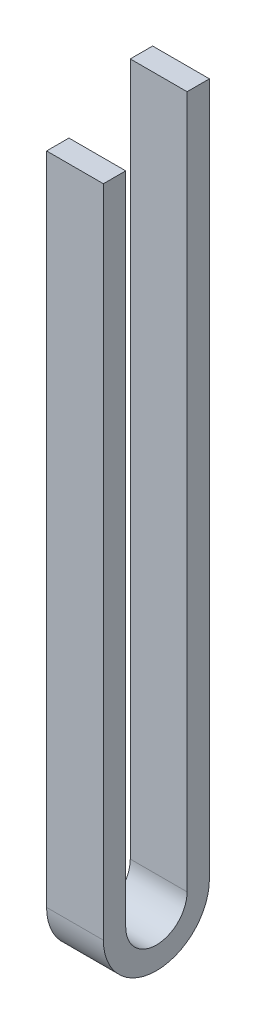
ISO-10303-21;
HEADER;
FILE_DESCRIPTION(('STEP AP214'),'2;1');
FILE_NAME('part.step','',(''),(''),'','','');
FILE_SCHEMA(('AUTOMOTIVE_DESIGN { 1 0 10303 214 1 1 1 1 }'));
ENDSEC;
DATA;
#1=APPLICATION_CONTEXT('core data for automotive mechanical design processes');
#2=APPLICATION_PROTOCOL_DEFINITION('international standard','automotive_design',2000,#1);
#3=PRODUCT_CONTEXT('',#1,'mechanical');
#4=PRODUCT('Part','Part','',(#3));
#5=PRODUCT_RELATED_PRODUCT_CATEGORY('part','',(#4));
#6=PRODUCT_DEFINITION_FORMATION('','',#4);
#7=PRODUCT_DEFINITION_CONTEXT('part definition',#1,'design');
#8=PRODUCT_DEFINITION('design','',#6,#7);
#9=PRODUCT_DEFINITION_SHAPE('','',#8);
#10=(LENGTH_UNIT() NAMED_UNIT(*) SI_UNIT(.MILLI.,.METRE.));
#11=(NAMED_UNIT(*) PLANE_ANGLE_UNIT() SI_UNIT($,.RADIAN.));
#12=(NAMED_UNIT(*) SI_UNIT($,.STERADIAN.) SOLID_ANGLE_UNIT());
#13=UNCERTAINTY_MEASURE_WITH_UNIT(LENGTH_MEASURE(1.E-05),#10,'distance_accuracy_value','');
#14=(GEOMETRIC_REPRESENTATION_CONTEXT(3) GLOBAL_UNCERTAINTY_ASSIGNED_CONTEXT((#13)) GLOBAL_UNIT_ASSIGNED_CONTEXT((#10,
#11,#12)) REPRESENTATION_CONTEXT('',''));
#15=CARTESIAN_POINT('',(0.,0.,0.));
#16=DIRECTION('',(0.,0.,1.));
#17=DIRECTION('',(1.,0.,0.));
#18=AXIS2_PLACEMENT_3D('',#15,#16,#17);
#19=CARTESIAN_POINT('',(38.1,0.,0.));
#20=DIRECTION('',(0.,-1.,0.));
#21=DIRECTION('',(0.,0.,-1.));
#22=AXIS2_PLACEMENT_3D('',#19,#20,#21);
#23=PLANE('',#22);
#24=DIRECTION('',(0.,0.,1.));
#25=VECTOR('',#24,1.);
#26=CARTESIAN_POINT('',(0.,0.,0.));
#27=LINE('',#26,#25);
#28=CARTESIAN_POINT('',(0.,0.,-14.986));
#29=VERTEX_POINT('',#28);
#30=CARTESIAN_POINT('',(0.,0.,0.));
#31=VERTEX_POINT('',#30);
#32=EDGE_CURVE('E149',#29,#31,#27,.T.);
#33=ORIENTED_EDGE('',*,*,#32,.T.);
#34=DIRECTION('',(-1.,0.,0.));
#35=VECTOR('',#34,1.);
#36=CARTESIAN_POINT('',(38.1,0.,0.));
#37=LINE('',#36,#35);
#38=CARTESIAN_POINT('',(38.1,0.,0.));
#39=VERTEX_POINT('',#38);
#40=EDGE_CURVE('E11',#39,#31,#37,.T.);
#41=ORIENTED_EDGE('',*,*,#40,.F.);
#42=DIRECTION('',(0.,0.,1.));
#43=VECTOR('',#42,1.);
#44=CARTESIAN_POINT('',(38.1,0.,0.));
#45=LINE('',#44,#43);
#46=CARTESIAN_POINT('',(38.1,0.,-14.986));
#47=VERTEX_POINT('',#46);
#48=EDGE_CURVE('E168',#47,#39,#45,.T.);
#49=ORIENTED_EDGE('',*,*,#48,.F.);
#50=DIRECTION('',(-1.,0.,0.));
#51=VECTOR('',#50,1.);
#52=CARTESIAN_POINT('',(38.1,0.,-14.986));
#53=LINE('',#52,#51);
#54=EDGE_CURVE('E145',#47,#29,#53,.T.);
#55=ORIENTED_EDGE('',*,*,#54,.T.);
#56=EDGE_LOOP('',(#33,#41,#49,#55));
#57=FACE_BOUND('',#56,.T.);
#58=ADVANCED_FACE('F47',(#57),#23,.F.);
#59=CARTESIAN_POINT('',(38.1,0.,0.));
#60=DIRECTION('',(0.,0.,-1.));
#61=DIRECTION('',(-1.,0.,0.));
#62=AXIS2_PLACEMENT_3D('',#59,#60,#61);
#63=PLANE('',#62);
#64=DIRECTION('',(0.,-1.,0.));
#65=VECTOR('',#64,1.);
#66=CARTESIAN_POINT('',(0.,0.,0.));
#67=LINE('',#66,#65);
#68=CARTESIAN_POINT('',(0.,-439.442482619173,0.));
#69=VERTEX_POINT('',#68);
#70=EDGE_CURVE('E152',#31,#69,#67,.T.);
#71=ORIENTED_EDGE('',*,*,#70,.T.);
#72=DIRECTION('',(-1.,0.,0.));
#73=VECTOR('',#72,1.);
#74=CARTESIAN_POINT('',(38.1,-439.442482619173,0.));
#75=LINE('',#74,#73);
#76=CARTESIAN_POINT('',(38.1,-439.442482619173,0.));
#77=VERTEX_POINT('',#76);
#78=EDGE_CURVE('E55',#77,#69,#75,.T.);
#79=ORIENTED_EDGE('',*,*,#78,.F.);
#80=DIRECTION('',(0.,-1.,0.));
#81=VECTOR('',#80,1.);
#82=CARTESIAN_POINT('',(38.1,0.,0.));
#83=LINE('',#82,#81);
#84=EDGE_CURVE('E109',#39,#77,#83,.T.);
#85=ORIENTED_EDGE('',*,*,#84,.F.);
#86=ORIENTED_EDGE('',*,*,#40,.T.);
#87=EDGE_LOOP('',(#71,#79,#85,#86));
#88=FACE_BOUND('',#87,.T.);
#89=ADVANCED_FACE('F206',(#88),#63,.F.);
#90=CARTESIAN_POINT('',(38.1,-439.442482619173,-35.56));
#91=DIRECTION('',(-1.,0.,0.));
#92=DIRECTION('',(0.,0.,1.));
#93=AXIS2_PLACEMENT_3D('',#90,#91,#92);
#94=CYLINDRICAL_SURFACE('',#93,35.56);
#95=CARTESIAN_POINT('',(0.,-439.442482619173,-35.56));
#96=DIRECTION('',(1.,0.,0.));
#97=DIRECTION('',(0.,0.,-1.));
#98=AXIS2_PLACEMENT_3D('',#95,#96,#97);
#99=CIRCLE('',#98,35.56);
#100=CARTESIAN_POINT('',(0.,-439.442482619173,-71.12));
#101=VERTEX_POINT('',#100);
#102=EDGE_CURVE('E154',#69,#101,#99,.T.);
#103=ORIENTED_EDGE('',*,*,#102,.T.);
#104=DIRECTION('',(-1.,0.,0.));
#105=VECTOR('',#104,1.);
#106=CARTESIAN_POINT('',(38.1,-439.442482619173,-71.12));
#107=LINE('',#106,#105);
#108=CARTESIAN_POINT('',(38.1,-439.442482619173,-71.12));
#109=VERTEX_POINT('',#108);
#110=EDGE_CURVE('E175',#109,#101,#107,.T.);
#111=ORIENTED_EDGE('',*,*,#110,.F.);
#112=CARTESIAN_POINT('',(38.1,-439.442482619173,-35.56));
#113=DIRECTION('',(1.,0.,0.));
#114=DIRECTION('',(0.,0.,-1.));
#115=AXIS2_PLACEMENT_3D('',#112,#113,#114);
#116=CIRCLE('',#115,35.56);
#117=EDGE_CURVE('E184',#77,#109,#116,.T.);
#118=ORIENTED_EDGE('',*,*,#117,.F.);
#119=ORIENTED_EDGE('',*,*,#78,.T.);
#120=EDGE_LOOP('',(#103,#111,#118,#119));
#121=FACE_BOUND('',#120,.T.);
#122=ADVANCED_FACE('F182',(#121),#94,.T.);
#123=CARTESIAN_POINT('',(38.1,-439.442482619173,-71.12));
#124=DIRECTION('',(0.,0.,1.));
#125=DIRECTION('',(1.,0.,0.));
#126=AXIS2_PLACEMENT_3D('',#123,#124,#125);
#127=PLANE('',#126);
#128=DIRECTION('',(0.,1.,0.));
#129=VECTOR('',#128,1.);
#130=CARTESIAN_POINT('',(0.,-439.442482619173,-71.12));
#131=LINE('',#130,#129);
#132=CARTESIAN_POINT('',(0.,25.3999999999999,-71.12));
#133=VERTEX_POINT('',#132);
#134=EDGE_CURVE('E157',#101,#133,#131,.T.);
#135=ORIENTED_EDGE('',*,*,#134,.T.);
#136=DIRECTION('',(-1.,0.,0.));
#137=VECTOR('',#136,1.);
#138=CARTESIAN_POINT('',(38.1,25.3999999999999,-71.12));
#139=LINE('',#138,#137);
#140=CARTESIAN_POINT('',(38.1,25.3999999999999,-71.12));
#141=VERTEX_POINT('',#140);
#142=EDGE_CURVE('E172',#141,#133,#139,.T.);
#143=ORIENTED_EDGE('',*,*,#142,.F.);
#144=DIRECTION('',(0.,1.,0.));
#145=VECTOR('',#144,1.);
#146=CARTESIAN_POINT('',(38.1,-439.442482619173,-71.12));
#147=LINE('',#146,#145);
#148=EDGE_CURVE('E196',#109,#141,#147,.T.);
#149=ORIENTED_EDGE('',*,*,#148,.F.);
#150=ORIENTED_EDGE('',*,*,#110,.T.);
#151=EDGE_LOOP('',(#135,#143,#149,#150));
#152=FACE_BOUND('',#151,.T.);
#153=ADVANCED_FACE('F192',(#152),#127,.F.);
#154=CARTESIAN_POINT('',(38.1,25.3999999999999,-56.134));
#155=DIRECTION('',(0.,-1.,0.));
#156=DIRECTION('',(0.,0.,-1.));
#157=AXIS2_PLACEMENT_3D('',#154,#155,#156);
#158=PLANE('',#157);
#159=DIRECTION('',(0.,0.,1.));
#160=VECTOR('',#159,1.);
#161=CARTESIAN_POINT('',(0.,25.3999999999999,-56.134));
#162=LINE('',#161,#160);
#163=CARTESIAN_POINT('',(0.,25.3999999999999,-56.134));
#164=VERTEX_POINT('',#163);
#165=EDGE_CURVE('E160',#133,#164,#162,.T.);
#166=ORIENTED_EDGE('',*,*,#165,.T.);
#167=DIRECTION('',(-1.,0.,0.));
#168=VECTOR('',#167,1.);
#169=CARTESIAN_POINT('',(38.1,25.3999999999999,-56.134));
#170=LINE('',#169,#168);
#171=CARTESIAN_POINT('',(38.1,25.3999999999999,-56.134));
#172=VERTEX_POINT('',#171);
#173=EDGE_CURVE('E139',#172,#164,#170,.T.);
#174=ORIENTED_EDGE('',*,*,#173,.F.);
#175=DIRECTION('',(0.,0.,1.));
#176=VECTOR('',#175,1.);
#177=CARTESIAN_POINT('',(38.1,25.3999999999999,-56.134));
#178=LINE('',#177,#176);
#179=EDGE_CURVE('E128',#141,#172,#178,.T.);
#180=ORIENTED_EDGE('',*,*,#179,.F.);
#181=ORIENTED_EDGE('',*,*,#142,.T.);
#182=EDGE_LOOP('',(#166,#174,#180,#181));
#183=FACE_BOUND('',#182,.T.);
#184=ADVANCED_FACE('F195',(#183),#158,.F.);
#185=CARTESIAN_POINT('',(38.1,-439.442482619173,-56.134));
#186=DIRECTION('',(0.,0.,-1.));
#187=DIRECTION('',(-1.,0.,0.));
#188=AXIS2_PLACEMENT_3D('',#185,#186,#187);
#189=PLANE('',#188);
#190=DIRECTION('',(0.,-1.,0.));
#191=VECTOR('',#190,1.);
#192=CARTESIAN_POINT('',(0.,-439.442482619173,-56.134));
#193=LINE('',#192,#191);
#194=CARTESIAN_POINT('',(0.,-439.442482619173,-56.134));
#195=VERTEX_POINT('',#194);
#196=EDGE_CURVE('E137',#164,#195,#193,.T.);
#197=ORIENTED_EDGE('',*,*,#196,.T.);
#198=DIRECTION('',(-1.,0.,0.));
#199=VECTOR('',#198,1.);
#200=CARTESIAN_POINT('',(38.1,-439.442482619173,-56.134));
#201=LINE('',#200,#199);
#202=CARTESIAN_POINT('',(38.1,-439.442482619173,-56.134));
#203=VERTEX_POINT('',#202);
#204=EDGE_CURVE('E134',#203,#195,#201,.T.);
#205=ORIENTED_EDGE('',*,*,#204,.F.);
#206=DIRECTION('',(0.,-1.,0.));
#207=VECTOR('',#206,1.);
#208=CARTESIAN_POINT('',(38.1,-439.442482619173,-56.134));
#209=LINE('',#208,#207);
#210=EDGE_CURVE('E122',#172,#203,#209,.T.);
#211=ORIENTED_EDGE('',*,*,#210,.F.);
#212=ORIENTED_EDGE('',*,*,#173,.T.);
#213=EDGE_LOOP('',(#197,#205,#211,#212));
#214=FACE_BOUND('',#213,.T.);
#215=ADVANCED_FACE('F135',(#214),#189,.F.);
#216=CARTESIAN_POINT('',(38.1,-439.442482619173,-35.56));
#217=DIRECTION('',(-1.,0.,0.));
#218=DIRECTION('',(0.,0.,1.));
#219=AXIS2_PLACEMENT_3D('',#216,#217,#218);
#220=CYLINDRICAL_SURFACE('',#219,20.574);
#221=CARTESIAN_POINT('',(0.,-439.442482619173,-35.56));
#222=DIRECTION('',(-1.,0.,0.));
#223=DIRECTION('',(0.,0.,-1.));
#224=AXIS2_PLACEMENT_3D('',#221,#222,#223);
#225=CIRCLE('',#224,20.574);
#226=CARTESIAN_POINT('',(0.,-439.442482619173,-14.986));
#227=VERTEX_POINT('',#226);
#228=EDGE_CURVE('E95',#195,#227,#225,.T.);
#229=ORIENTED_EDGE('',*,*,#228,.T.);
#230=DIRECTION('',(-1.,0.,0.));
#231=VECTOR('',#230,1.);
#232=CARTESIAN_POINT('',(38.1,-439.442482619173,-14.986));
#233=LINE('',#232,#231);
#234=CARTESIAN_POINT('',(38.1,-439.442482619173,-14.986));
#235=VERTEX_POINT('',#234);
#236=EDGE_CURVE('E140',#235,#227,#233,.T.);
#237=ORIENTED_EDGE('',*,*,#236,.F.);
#238=CARTESIAN_POINT('',(38.1,-439.442482619173,-35.56));
#239=DIRECTION('',(-1.,0.,0.));
#240=DIRECTION('',(0.,0.,-1.));
#241=AXIS2_PLACEMENT_3D('',#238,#239,#240);
#242=CIRCLE('',#241,20.574);
#243=EDGE_CURVE('E126',#203,#235,#242,.T.);
#244=ORIENTED_EDGE('',*,*,#243,.F.);
#245=ORIENTED_EDGE('',*,*,#204,.T.);
#246=EDGE_LOOP('',(#229,#237,#244,#245));
#247=FACE_BOUND('',#246,.T.);
#248=ADVANCED_FACE('F142',(#247),#220,.F.);
#249=CARTESIAN_POINT('',(38.1,0.,-14.986));
#250=DIRECTION('',(0.,0.,1.));
#251=DIRECTION('',(1.,0.,0.));
#252=AXIS2_PLACEMENT_3D('',#249,#250,#251);
#253=PLANE('',#252);
#254=DIRECTION('',(0.,1.,0.));
#255=VECTOR('',#254,1.);
#256=CARTESIAN_POINT('',(0.,0.,-14.986));
#257=LINE('',#256,#255);
#258=EDGE_CURVE('E101',#227,#29,#257,.T.);
#259=ORIENTED_EDGE('',*,*,#258,.T.);
#260=ORIENTED_EDGE('',*,*,#54,.F.);
#261=DIRECTION('',(0.,1.,0.));
#262=VECTOR('',#261,1.);
#263=CARTESIAN_POINT('',(38.1,0.,-14.986));
#264=LINE('',#263,#262);
#265=EDGE_CURVE('E63',#235,#47,#264,.T.);
#266=ORIENTED_EDGE('',*,*,#265,.F.);
#267=ORIENTED_EDGE('',*,*,#236,.T.);
#268=EDGE_LOOP('',(#259,#260,#266,#267));
#269=FACE_BOUND('',#268,.T.);
#270=ADVANCED_FACE('F223',(#269),#253,.F.);
#271=CARTESIAN_POINT('',(38.1,-439.442482619173,-35.56));
#272=DIRECTION('',(1.,0.,0.));
#273=DIRECTION('',(0.,0.,-1.));
#274=AXIS2_PLACEMENT_3D('',#271,#272,#273);
#275=PLANE('',#274);
#276=ORIENTED_EDGE('',*,*,#48,.T.);
#277=ORIENTED_EDGE('',*,*,#84,.T.);
#278=ORIENTED_EDGE('',*,*,#117,.T.);
#279=ORIENTED_EDGE('',*,*,#148,.T.);
#280=ORIENTED_EDGE('',*,*,#179,.T.);
#281=ORIENTED_EDGE('',*,*,#210,.T.);
#282=ORIENTED_EDGE('',*,*,#243,.T.);
#283=ORIENTED_EDGE('',*,*,#265,.T.);
#284=EDGE_LOOP('',(#276,#277,#278,#279,#280,#281,#282,#283));
#285=FACE_BOUND('',#284,.T.);
#286=ADVANCED_FACE('F124',(#285),#275,.T.);
#287=CARTESIAN_POINT('',(0.,-439.442482619173,-35.56));
#288=DIRECTION('',(1.,0.,0.));
#289=DIRECTION('',(0.,0.,-1.));
#290=AXIS2_PLACEMENT_3D('',#287,#288,#289);
#291=PLANE('',#290);
#292=ORIENTED_EDGE('',*,*,#32,.F.);
#293=ORIENTED_EDGE('',*,*,#258,.F.);
#294=ORIENTED_EDGE('',*,*,#228,.F.);
#295=ORIENTED_EDGE('',*,*,#196,.F.);
#296=ORIENTED_EDGE('',*,*,#165,.F.);
#297=ORIENTED_EDGE('',*,*,#134,.F.);
#298=ORIENTED_EDGE('',*,*,#102,.F.);
#299=ORIENTED_EDGE('',*,*,#70,.F.);
#300=EDGE_LOOP('',(#292,#293,#294,#295,#296,#297,#298,#299));
#301=FACE_BOUND('',#300,.T.);
#302=ADVANCED_FACE('F188',(#301),#291,.F.);
#303=CLOSED_SHELL('',(#58,#89,#122,#153,#184,#215,#248,#270,#286,#302));
#304=MANIFOLD_SOLID_BREP('B2',#303);
#305=ADVANCED_BREP_SHAPE_REPRESENTATION('',(#18,#304),#14);
#306=SHAPE_DEFINITION_REPRESENTATION(#9,#305);
ENDSEC;
END-ISO-10303-21;
